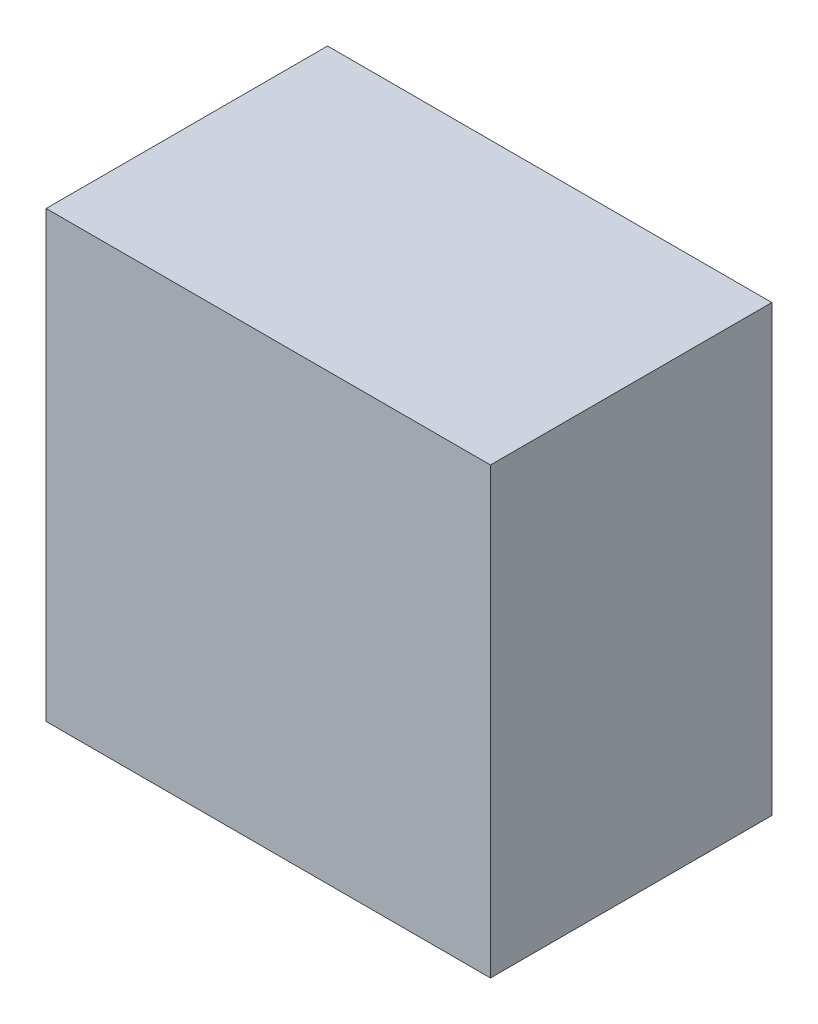
ISO-10303-21;
HEADER;
FILE_DESCRIPTION(('STEP AP214'),'2;1');
FILE_NAME('part.step','',(''),(''),'','','');
FILE_SCHEMA(('AUTOMOTIVE_DESIGN { 1 0 10303 214 1 1 1 1 }'));
ENDSEC;
DATA;
#1=APPLICATION_CONTEXT('core data for automotive mechanical design processes');
#2=APPLICATION_PROTOCOL_DEFINITION('international standard','automotive_design',2000,#1);
#3=PRODUCT_CONTEXT('',#1,'mechanical');
#4=PRODUCT('Part','Part','',(#3));
#5=PRODUCT_RELATED_PRODUCT_CATEGORY('part','',(#4));
#6=PRODUCT_DEFINITION_FORMATION('','',#4);
#7=PRODUCT_DEFINITION_CONTEXT('part definition',#1,'design');
#8=PRODUCT_DEFINITION('design','',#6,#7);
#9=PRODUCT_DEFINITION_SHAPE('','',#8);
#10=(LENGTH_UNIT() NAMED_UNIT(*) SI_UNIT(.MILLI.,.METRE.));
#11=(NAMED_UNIT(*) PLANE_ANGLE_UNIT() SI_UNIT($,.RADIAN.));
#12=(NAMED_UNIT(*) SI_UNIT($,.STERADIAN.) SOLID_ANGLE_UNIT());
#13=UNCERTAINTY_MEASURE_WITH_UNIT(LENGTH_MEASURE(1.E-05),#10,'distance_accuracy_value','');
#14=(GEOMETRIC_REPRESENTATION_CONTEXT(3) GLOBAL_UNCERTAINTY_ASSIGNED_CONTEXT((#13)) GLOBAL_UNIT_ASSIGNED_CONTEXT((#10,
#11,#12)) REPRESENTATION_CONTEXT('',''));
#15=CARTESIAN_POINT('',(0.,0.,0.));
#16=DIRECTION('',(0.,0.,1.));
#17=DIRECTION('',(1.,0.,0.));
#18=AXIS2_PLACEMENT_3D('',#15,#16,#17);
#19=CARTESIAN_POINT('',(0.,0.,38.));
#20=DIRECTION('',(1.,0.,0.));
#21=DIRECTION('',(0.,0.,-1.));
#22=AXIS2_PLACEMENT_3D('',#19,#20,#21);
#23=PLANE('',#22);
#24=DIRECTION('',(0.,-1.,0.));
#25=VECTOR('',#24,1.);
#26=CARTESIAN_POINT('',(0.,0.,0.));
#27=LINE('',#26,#25);
#28=CARTESIAN_POINT('',(0.,60.,0.));
#29=VERTEX_POINT('',#28);
#30=CARTESIAN_POINT('',(0.,0.,0.));
#31=VERTEX_POINT('',#30);
#32=EDGE_CURVE('E117',#29,#31,#27,.T.);
#33=ORIENTED_EDGE('',*,*,#32,.T.);
#34=DIRECTION('',(0.,0.,-1.));
#35=VECTOR('',#34,1.);
#36=CARTESIAN_POINT('',(0.,0.,38.));
#37=LINE('',#36,#35);
#38=CARTESIAN_POINT('',(0.,0.,38.));
#39=VERTEX_POINT('',#38);
#40=EDGE_CURVE('E11',#39,#31,#37,.T.);
#41=ORIENTED_EDGE('',*,*,#40,.F.);
#42=DIRECTION('',(0.,-1.,0.));
#43=VECTOR('',#42,1.);
#44=CARTESIAN_POINT('',(0.,0.,38.));
#45=LINE('',#44,#43);
#46=CARTESIAN_POINT('',(0.,60.,38.));
#47=VERTEX_POINT('',#46);
#48=EDGE_CURVE('E101',#47,#39,#45,.T.);
#49=ORIENTED_EDGE('',*,*,#48,.F.);
#50=DIRECTION('',(0.,0.,-1.));
#51=VECTOR('',#50,1.);
#52=CARTESIAN_POINT('',(0.,60.,38.));
#53=LINE('',#52,#51);
#54=EDGE_CURVE('E113',#47,#29,#53,.T.);
#55=ORIENTED_EDGE('',*,*,#54,.T.);
#56=EDGE_LOOP('',(#33,#41,#49,#55));
#57=FACE_BOUND('',#56,.T.);
#58=ADVANCED_FACE('F49',(#57),#23,.F.);
#59=CARTESIAN_POINT('',(0.,0.,38.));
#60=DIRECTION('',(0.,1.,0.));
#61=DIRECTION('',(0.,0.,1.));
#62=AXIS2_PLACEMENT_3D('',#59,#60,#61);
#63=PLANE('',#62);
#64=DIRECTION('',(1.,0.,0.));
#65=VECTOR('',#64,1.);
#66=CARTESIAN_POINT('',(0.,0.,0.));
#67=LINE('',#66,#65);
#68=CARTESIAN_POINT('',(60.,0.,0.));
#69=VERTEX_POINT('',#68);
#70=EDGE_CURVE('E106',#31,#69,#67,.T.);
#71=ORIENTED_EDGE('',*,*,#70,.T.);
#72=DIRECTION('',(0.,0.,-1.));
#73=VECTOR('',#72,1.);
#74=CARTESIAN_POINT('',(60.,0.,38.));
#75=LINE('',#74,#73);
#76=CARTESIAN_POINT('',(60.,0.,38.));
#77=VERTEX_POINT('',#76);
#78=EDGE_CURVE('E58',#77,#69,#75,.T.);
#79=ORIENTED_EDGE('',*,*,#78,.F.);
#80=DIRECTION('',(1.,0.,0.));
#81=VECTOR('',#80,1.);
#82=CARTESIAN_POINT('',(0.,0.,38.));
#83=LINE('',#82,#81);
#84=EDGE_CURVE('E96',#39,#77,#83,.T.);
#85=ORIENTED_EDGE('',*,*,#84,.F.);
#86=ORIENTED_EDGE('',*,*,#40,.T.);
#87=EDGE_LOOP('',(#71,#79,#85,#86));
#88=FACE_BOUND('',#87,.T.);
#89=ADVANCED_FACE('F105',(#88),#63,.F.);
#90=CARTESIAN_POINT('',(60.,0.,38.));
#91=DIRECTION('',(-1.,0.,0.));
#92=DIRECTION('',(0.,0.,1.));
#93=AXIS2_PLACEMENT_3D('',#90,#91,#92);
#94=PLANE('',#93);
#95=DIRECTION('',(0.,1.,0.));
#96=VECTOR('',#95,1.);
#97=CARTESIAN_POINT('',(60.,0.,0.));
#98=LINE('',#97,#96);
#99=CARTESIAN_POINT('',(60.,60.,0.));
#100=VERTEX_POINT('',#99);
#101=EDGE_CURVE('E83',#69,#100,#98,.T.);
#102=ORIENTED_EDGE('',*,*,#101,.T.);
#103=DIRECTION('',(0.,0.,-1.));
#104=VECTOR('',#103,1.);
#105=CARTESIAN_POINT('',(60.,60.,38.));
#106=LINE('',#105,#104);
#107=CARTESIAN_POINT('',(60.,60.,38.));
#108=VERTEX_POINT('',#107);
#109=EDGE_CURVE('E108',#108,#100,#106,.T.);
#110=ORIENTED_EDGE('',*,*,#109,.F.);
#111=DIRECTION('',(0.,1.,0.));
#112=VECTOR('',#111,1.);
#113=CARTESIAN_POINT('',(60.,0.,38.));
#114=LINE('',#113,#112);
#115=EDGE_CURVE('E99',#77,#108,#114,.T.);
#116=ORIENTED_EDGE('',*,*,#115,.F.);
#117=ORIENTED_EDGE('',*,*,#78,.T.);
#118=EDGE_LOOP('',(#102,#110,#116,#117));
#119=FACE_BOUND('',#118,.T.);
#120=ADVANCED_FACE('F109',(#119),#94,.F.);
#121=CARTESIAN_POINT('',(0.,60.,38.));
#122=DIRECTION('',(0.,-1.,0.));
#123=DIRECTION('',(0.,0.,-1.));
#124=AXIS2_PLACEMENT_3D('',#121,#122,#123);
#125=PLANE('',#124);
#126=DIRECTION('',(-1.,0.,0.));
#127=VECTOR('',#126,1.);
#128=CARTESIAN_POINT('',(0.,60.,0.));
#129=LINE('',#128,#127);
#130=EDGE_CURVE('E89',#100,#29,#129,.T.);
#131=ORIENTED_EDGE('',*,*,#130,.T.);
#132=ORIENTED_EDGE('',*,*,#54,.F.);
#133=DIRECTION('',(-1.,0.,0.));
#134=VECTOR('',#133,1.);
#135=CARTESIAN_POINT('',(0.,60.,38.));
#136=LINE('',#135,#134);
#137=EDGE_CURVE('E66',#108,#47,#136,.T.);
#138=ORIENTED_EDGE('',*,*,#137,.F.);
#139=ORIENTED_EDGE('',*,*,#109,.T.);
#140=EDGE_LOOP('',(#131,#132,#138,#139));
#141=FACE_BOUND('',#140,.T.);
#142=ADVANCED_FACE('F130',(#141),#125,.F.);
#143=CARTESIAN_POINT('',(0.,0.,38.));
#144=DIRECTION('',(0.,0.,-1.));
#145=DIRECTION('',(-1.,0.,0.));
#146=AXIS2_PLACEMENT_3D('',#143,#144,#145);
#147=PLANE('',#146);
#148=ORIENTED_EDGE('',*,*,#48,.T.);
#149=ORIENTED_EDGE('',*,*,#84,.T.);
#150=ORIENTED_EDGE('',*,*,#115,.T.);
#151=ORIENTED_EDGE('',*,*,#137,.T.);
#152=EDGE_LOOP('',(#148,#149,#150,#151));
#153=FACE_BOUND('',#152,.T.);
#154=ADVANCED_FACE('F97',(#153),#147,.F.);
#155=CARTESIAN_POINT('',(0.,0.,0.));
#156=DIRECTION('',(0.,0.,-1.));
#157=DIRECTION('',(-1.,0.,0.));
#158=AXIS2_PLACEMENT_3D('',#155,#156,#157);
#159=PLANE('',#158);
#160=ORIENTED_EDGE('',*,*,#32,.F.);
#161=ORIENTED_EDGE('',*,*,#130,.F.);
#162=ORIENTED_EDGE('',*,*,#101,.F.);
#163=ORIENTED_EDGE('',*,*,#70,.F.);
#164=EDGE_LOOP('',(#160,#161,#162,#163));
#165=FACE_BOUND('',#164,.T.);
#166=ADVANCED_FACE('F133',(#165),#159,.T.);
#167=CLOSED_SHELL('',(#58,#89,#120,#142,#154,#166));
#168=MANIFOLD_SOLID_BREP('B2',#167);
#169=ADVANCED_BREP_SHAPE_REPRESENTATION('',(#18,#168),#14);
#170=SHAPE_DEFINITION_REPRESENTATION(#9,#169);
ENDSEC;
END-ISO-10303-21;
